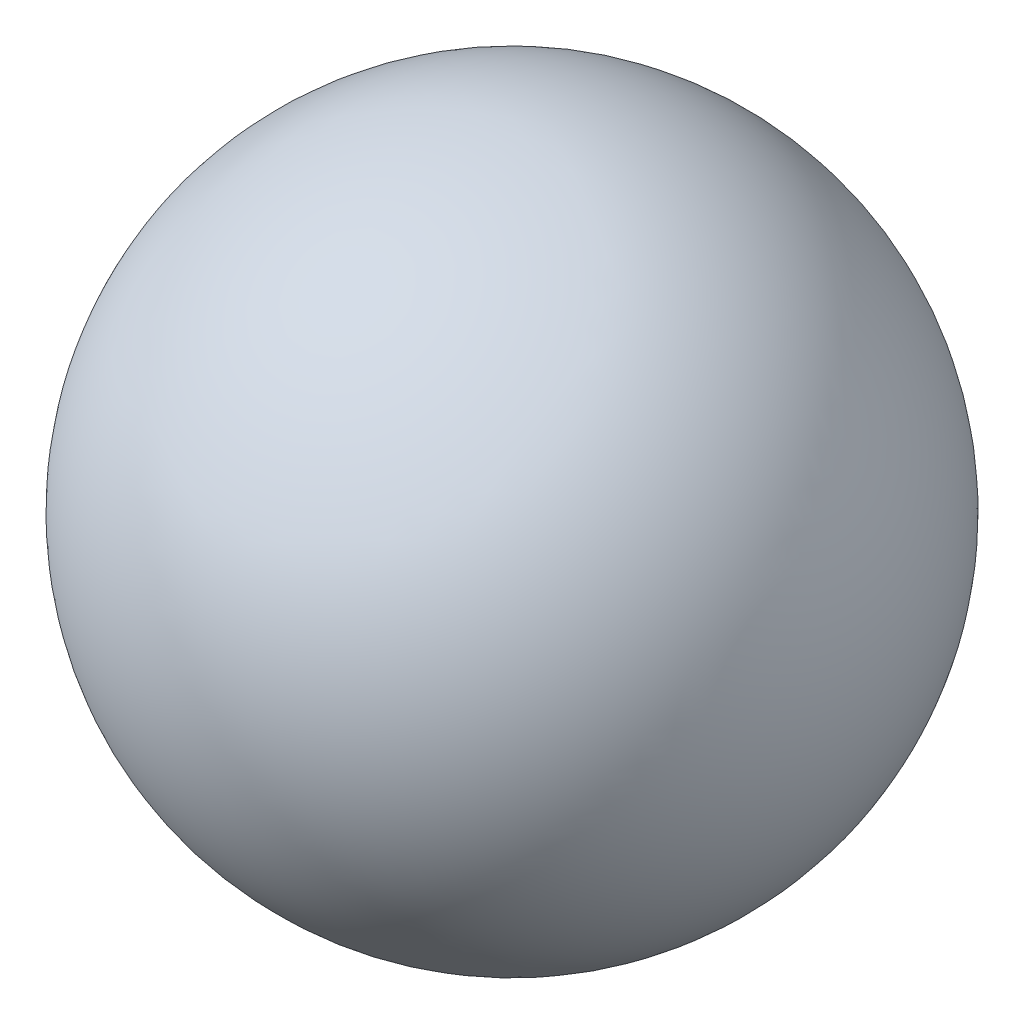
ISO-10303-21;
HEADER;
FILE_DESCRIPTION(('STEP AP214'),'2;1');
FILE_NAME('part.step','',(''),(''),'','','');
FILE_SCHEMA(('AUTOMOTIVE_DESIGN { 1 0 10303 214 1 1 1 1 }'));
ENDSEC;
DATA;
#1=APPLICATION_CONTEXT('core data for automotive mechanical design processes');
#2=APPLICATION_PROTOCOL_DEFINITION('international standard','automotive_design',2000,#1);
#3=PRODUCT_CONTEXT('',#1,'mechanical');
#4=PRODUCT('Part','Part','',(#3));
#5=PRODUCT_RELATED_PRODUCT_CATEGORY('part','',(#4));
#6=PRODUCT_DEFINITION_FORMATION('','',#4);
#7=PRODUCT_DEFINITION_CONTEXT('part definition',#1,'design');
#8=PRODUCT_DEFINITION('design','',#6,#7);
#9=PRODUCT_DEFINITION_SHAPE('','',#8);
#10=(LENGTH_UNIT() NAMED_UNIT(*) SI_UNIT(.MILLI.,.METRE.));
#11=(NAMED_UNIT(*) PLANE_ANGLE_UNIT() SI_UNIT($,.RADIAN.));
#12=(NAMED_UNIT(*) SI_UNIT($,.STERADIAN.) SOLID_ANGLE_UNIT());
#13=UNCERTAINTY_MEASURE_WITH_UNIT(LENGTH_MEASURE(1.E-05),#10,'distance_accuracy_value','');
#14=(GEOMETRIC_REPRESENTATION_CONTEXT(3) GLOBAL_UNCERTAINTY_ASSIGNED_CONTEXT((#13)) GLOBAL_UNIT_ASSIGNED_CONTEXT((#10,
#11,#12)) REPRESENTATION_CONTEXT('',''));
#15=CARTESIAN_POINT('',(0.,0.,0.));
#16=DIRECTION('',(0.,0.,1.));
#17=DIRECTION('',(1.,0.,0.));
#18=AXIS2_PLACEMENT_3D('',#15,#16,#17);
#19=CARTESIAN_POINT('',(0.,0.,0.));
#20=DIRECTION('',(-1.,0.,0.));
#21=DIRECTION('',(0.,0.,-1.));
#22=AXIS2_PLACEMENT_3D('',#19,#20,#21);
#23=SPHERICAL_SURFACE('',#22,203.2);
#24=CARTESIAN_POINT('',(-203.2,0.,0.));
#25=VERTEX_POINT('',#24);
#26=VERTEX_LOOP('',#25);
#27=FACE_BOUND('',#26,.T.);
#28=ADVANCED_FACE('F35',(#27),#23,.T.);
#29=CLOSED_SHELL('',(#28));
#30=MANIFOLD_SOLID_BREP('B2',#29);
#31=ADVANCED_BREP_SHAPE_REPRESENTATION('',(#18,#30),#14);
#32=SHAPE_DEFINITION_REPRESENTATION(#9,#31);
ENDSEC;
END-ISO-10303-21;
